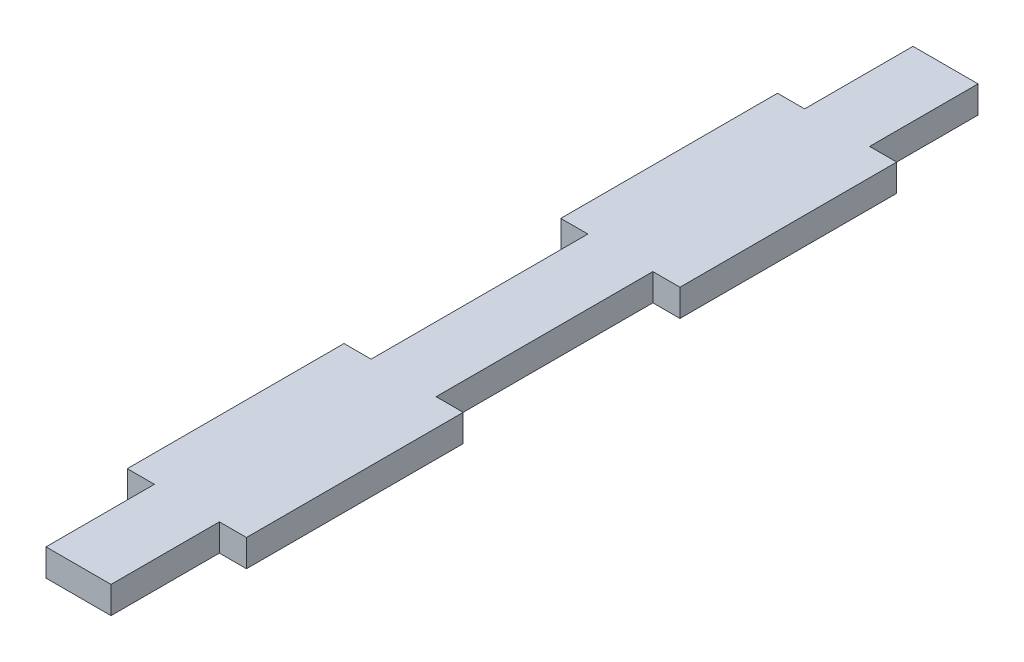
ISO-10303-21;
HEADER;
FILE_DESCRIPTION(('STEP AP214'),'2;1');
FILE_NAME('part.step','',(''),(''),'','','');
FILE_SCHEMA(('AUTOMOTIVE_DESIGN { 1 0 10303 214 1 1 1 1 }'));
ENDSEC;
DATA;
#1=APPLICATION_CONTEXT('core data for automotive mechanical design processes');
#2=APPLICATION_PROTOCOL_DEFINITION('international standard','automotive_design',2000,#1);
#3=PRODUCT_CONTEXT('',#1,'mechanical');
#4=PRODUCT('Part','Part','',(#3));
#5=PRODUCT_RELATED_PRODUCT_CATEGORY('part','',(#4));
#6=PRODUCT_DEFINITION_FORMATION('','',#4);
#7=PRODUCT_DEFINITION_CONTEXT('part definition',#1,'design');
#8=PRODUCT_DEFINITION('design','',#6,#7);
#9=PRODUCT_DEFINITION_SHAPE('','',#8);
#10=(LENGTH_UNIT() NAMED_UNIT(*) SI_UNIT(.MILLI.,.METRE.));
#11=(NAMED_UNIT(*) PLANE_ANGLE_UNIT() SI_UNIT($,.RADIAN.));
#12=(NAMED_UNIT(*) SI_UNIT($,.STERADIAN.) SOLID_ANGLE_UNIT());
#13=UNCERTAINTY_MEASURE_WITH_UNIT(LENGTH_MEASURE(1.E-05),#10,'distance_accuracy_value','');
#14=(GEOMETRIC_REPRESENTATION_CONTEXT(3) GLOBAL_UNCERTAINTY_ASSIGNED_CONTEXT((#13)) GLOBAL_UNIT_ASSIGNED_CONTEXT((#10,
#11,#12)) REPRESENTATION_CONTEXT('',''));
#15=CARTESIAN_POINT('',(0.,0.,0.));
#16=DIRECTION('',(0.,0.,1.));
#17=DIRECTION('',(1.,0.,0.));
#18=AXIS2_PLACEMENT_3D('',#15,#16,#17);
#19=CARTESIAN_POINT('',(10.795,3.175,0.));
#20=DIRECTION('',(1.,0.,0.));
#21=DIRECTION('',(0.,0.,-1.));
#22=AXIS2_PLACEMENT_3D('',#19,#20,#21);
#23=PLANE('',#22);
#24=DIRECTION('',(0.,0.,1.));
#25=VECTOR('',#24,1.);
#26=CARTESIAN_POINT('',(10.795,0.,0.));
#27=LINE('',#26,#25);
#28=CARTESIAN_POINT('',(10.795,0.,-38.1));
#29=VERTEX_POINT('',#28);
#30=CARTESIAN_POINT('',(10.795,0.,-12.7));
#31=VERTEX_POINT('',#30);
#32=EDGE_CURVE('E199',#29,#31,#27,.T.);
#33=ORIENTED_EDGE('',*,*,#32,.F.);
#34=DIRECTION('',(0.,-1.,0.));
#35=VECTOR('',#34,1.);
#36=CARTESIAN_POINT('',(10.795,3.175,-38.1));
#37=LINE('',#36,#35);
#38=CARTESIAN_POINT('',(10.795,3.175,-38.1));
#39=VERTEX_POINT('',#38);
#40=EDGE_CURVE('E11',#39,#29,#37,.T.);
#41=ORIENTED_EDGE('',*,*,#40,.F.);
#42=DIRECTION('',(0.,0.,1.));
#43=VECTOR('',#42,1.);
#44=CARTESIAN_POINT('',(10.795,3.175,0.));
#45=LINE('',#44,#43);
#46=CARTESIAN_POINT('',(10.795,3.175,-12.7));
#47=VERTEX_POINT('',#46);
#48=EDGE_CURVE('E251',#39,#47,#45,.T.);
#49=ORIENTED_EDGE('',*,*,#48,.T.);
#50=DIRECTION('',(0.,-1.,0.));
#51=VECTOR('',#50,1.);
#52=CARTESIAN_POINT('',(10.795,3.175,-12.7));
#53=LINE('',#52,#51);
#54=EDGE_CURVE('E122',#47,#31,#53,.T.);
#55=ORIENTED_EDGE('',*,*,#54,.T.);
#56=EDGE_LOOP('',(#33,#41,#49,#55));
#57=FACE_BOUND('',#56,.T.);
#58=ADVANCED_FACE('F35',(#57),#23,.T.);
#59=CARTESIAN_POINT('',(0.,3.175,-38.1));
#60=DIRECTION('',(0.,0.,-1.));
#61=DIRECTION('',(-1.,0.,0.));
#62=AXIS2_PLACEMENT_3D('',#59,#60,#61);
#63=PLANE('',#62);
#64=DIRECTION('',(1.,0.,0.));
#65=VECTOR('',#64,1.);
#66=CARTESIAN_POINT('',(0.,0.,-38.1));
#67=LINE('',#66,#65);
#68=CARTESIAN_POINT('',(7.62,0.,-38.1));
#69=VERTEX_POINT('',#68);
#70=EDGE_CURVE('E202',#69,#29,#67,.T.);
#71=ORIENTED_EDGE('',*,*,#70,.F.);
#72=DIRECTION('',(0.,-1.,0.));
#73=VECTOR('',#72,1.);
#74=CARTESIAN_POINT('',(7.62,3.175,-38.1));
#75=LINE('',#74,#73);
#76=CARTESIAN_POINT('',(7.62,3.175,-38.1));
#77=VERTEX_POINT('',#76);
#78=EDGE_CURVE('E43',#77,#69,#75,.T.);
#79=ORIENTED_EDGE('',*,*,#78,.F.);
#80=DIRECTION('',(1.,0.,0.));
#81=VECTOR('',#80,1.);
#82=CARTESIAN_POINT('',(0.,3.175,-38.1));
#83=LINE('',#82,#81);
#84=EDGE_CURVE('E299',#77,#39,#83,.T.);
#85=ORIENTED_EDGE('',*,*,#84,.T.);
#86=ORIENTED_EDGE('',*,*,#40,.T.);
#87=EDGE_LOOP('',(#71,#79,#85,#86));
#88=FACE_BOUND('',#87,.T.);
#89=ADVANCED_FACE('F298',(#88),#63,.T.);
#90=CARTESIAN_POINT('',(7.62,3.175,0.));
#91=DIRECTION('',(-1.,0.,0.));
#92=DIRECTION('',(0.,0.,1.));
#93=AXIS2_PLACEMENT_3D('',#90,#91,#92);
#94=PLANE('',#93);
#95=DIRECTION('',(0.,0.,-1.));
#96=VECTOR('',#95,1.);
#97=CARTESIAN_POINT('',(7.62,0.,0.));
#98=LINE('',#97,#96);
#99=CARTESIAN_POINT('',(7.62,0.,-63.5));
#100=VERTEX_POINT('',#99);
#101=EDGE_CURVE('E205',#69,#100,#98,.T.);
#102=ORIENTED_EDGE('',*,*,#101,.T.);
#103=DIRECTION('',(0.,-1.,0.));
#104=VECTOR('',#103,1.);
#105=CARTESIAN_POINT('',(7.62,3.175,-63.5));
#106=LINE('',#105,#104);
#107=CARTESIAN_POINT('',(7.62,3.175,-63.5));
#108=VERTEX_POINT('',#107);
#109=EDGE_CURVE('E283',#108,#100,#106,.T.);
#110=ORIENTED_EDGE('',*,*,#109,.F.);
#111=DIRECTION('',(0.,0.,-1.));
#112=VECTOR('',#111,1.);
#113=CARTESIAN_POINT('',(7.62,3.175,0.));
#114=LINE('',#113,#112);
#115=EDGE_CURVE('E290',#77,#108,#114,.T.);
#116=ORIENTED_EDGE('',*,*,#115,.F.);
#117=ORIENTED_EDGE('',*,*,#78,.T.);
#118=EDGE_LOOP('',(#102,#110,#116,#117));
#119=FACE_BOUND('',#118,.T.);
#120=ADVANCED_FACE('F288',(#119),#94,.F.);
#121=CARTESIAN_POINT('',(0.,3.175,-63.5));
#122=DIRECTION('',(0.,0.,-1.));
#123=DIRECTION('',(-1.,0.,0.));
#124=AXIS2_PLACEMENT_3D('',#121,#122,#123);
#125=PLANE('',#124);
#126=DIRECTION('',(1.,0.,0.));
#127=VECTOR('',#126,1.);
#128=CARTESIAN_POINT('',(0.,0.,-63.5));
#129=LINE('',#128,#127);
#130=CARTESIAN_POINT('',(10.795,0.,-63.5));
#131=VERTEX_POINT('',#130);
#132=EDGE_CURVE('E207',#100,#131,#129,.T.);
#133=ORIENTED_EDGE('',*,*,#132,.T.);
#134=DIRECTION('',(0.,-1.,0.));
#135=VECTOR('',#134,1.);
#136=CARTESIAN_POINT('',(10.795,3.175,-63.5));
#137=LINE('',#136,#135);
#138=CARTESIAN_POINT('',(10.795,3.175,-63.5));
#139=VERTEX_POINT('',#138);
#140=EDGE_CURVE('E281',#139,#131,#137,.T.);
#141=ORIENTED_EDGE('',*,*,#140,.F.);
#142=DIRECTION('',(1.,0.,0.));
#143=VECTOR('',#142,1.);
#144=CARTESIAN_POINT('',(0.,3.175,-63.5));
#145=LINE('',#144,#143);
#146=EDGE_CURVE('E307',#108,#139,#145,.T.);
#147=ORIENTED_EDGE('',*,*,#146,.F.);
#148=ORIENTED_EDGE('',*,*,#109,.T.);
#149=EDGE_LOOP('',(#133,#141,#147,#148));
#150=FACE_BOUND('',#149,.T.);
#151=ADVANCED_FACE('F395',(#150),#125,.F.);
#152=CARTESIAN_POINT('',(10.795,3.175,0.));
#153=DIRECTION('',(1.,0.,0.));
#154=DIRECTION('',(0.,0.,-1.));
#155=AXIS2_PLACEMENT_3D('',#152,#153,#154);
#156=PLANE('',#155);
#157=DIRECTION('',(0.,0.,1.));
#158=VECTOR('',#157,1.);
#159=CARTESIAN_POINT('',(10.795,0.,0.));
#160=LINE('',#159,#158);
#161=CARTESIAN_POINT('',(10.795,0.,-88.9));
#162=VERTEX_POINT('',#161);
#163=EDGE_CURVE('E210',#162,#131,#160,.T.);
#164=ORIENTED_EDGE('',*,*,#163,.F.);
#165=DIRECTION('',(0.,-1.,0.));
#166=VECTOR('',#165,1.);
#167=CARTESIAN_POINT('',(10.795,3.175,-88.9));
#168=LINE('',#167,#166);
#169=CARTESIAN_POINT('',(10.795,3.175,-88.9));
#170=VERTEX_POINT('',#169);
#171=EDGE_CURVE('E279',#170,#162,#168,.T.);
#172=ORIENTED_EDGE('',*,*,#171,.F.);
#173=DIRECTION('',(0.,0.,1.));
#174=VECTOR('',#173,1.);
#175=CARTESIAN_POINT('',(10.795,3.175,0.));
#176=LINE('',#175,#174);
#177=EDGE_CURVE('E309',#170,#139,#176,.T.);
#178=ORIENTED_EDGE('',*,*,#177,.T.);
#179=ORIENTED_EDGE('',*,*,#140,.T.);
#180=EDGE_LOOP('',(#164,#172,#178,#179));
#181=FACE_BOUND('',#180,.T.);
#182=ADVANCED_FACE('F391',(#181),#156,.T.);
#183=CARTESIAN_POINT('',(0.,3.175,-88.9));
#184=DIRECTION('',(0.,0.,-1.));
#185=DIRECTION('',(-1.,0.,0.));
#186=AXIS2_PLACEMENT_3D('',#183,#184,#185);
#187=PLANE('',#186);
#188=DIRECTION('',(1.,0.,0.));
#189=VECTOR('',#188,1.);
#190=CARTESIAN_POINT('',(0.,0.,-88.9));
#191=LINE('',#190,#189);
#192=CARTESIAN_POINT('',(7.62,0.,-88.9));
#193=VERTEX_POINT('',#192);
#194=EDGE_CURVE('E213',#193,#162,#191,.T.);
#195=ORIENTED_EDGE('',*,*,#194,.F.);
#196=DIRECTION('',(0.,-1.,0.));
#197=VECTOR('',#196,1.);
#198=CARTESIAN_POINT('',(7.62,3.175,-88.9));
#199=LINE('',#198,#197);
#200=CARTESIAN_POINT('',(7.62,3.175,-88.9));
#201=VERTEX_POINT('',#200);
#202=EDGE_CURVE('E277',#201,#193,#199,.T.);
#203=ORIENTED_EDGE('',*,*,#202,.F.);
#204=DIRECTION('',(1.,0.,0.));
#205=VECTOR('',#204,1.);
#206=CARTESIAN_POINT('',(0.,3.175,-88.9));
#207=LINE('',#206,#205);
#208=EDGE_CURVE('E312',#201,#170,#207,.T.);
#209=ORIENTED_EDGE('',*,*,#208,.T.);
#210=ORIENTED_EDGE('',*,*,#171,.T.);
#211=EDGE_LOOP('',(#195,#203,#209,#210));
#212=FACE_BOUND('',#211,.T.);
#213=ADVANCED_FACE('F387',(#212),#187,.T.);
#214=CARTESIAN_POINT('',(7.62000000000001,3.175,0.));
#215=DIRECTION('',(1.,0.,0.));
#216=DIRECTION('',(0.,0.,-1.));
#217=AXIS2_PLACEMENT_3D('',#214,#215,#216);
#218=PLANE('',#217);
#219=DIRECTION('',(0.,0.,1.));
#220=VECTOR('',#219,1.);
#221=CARTESIAN_POINT('',(7.62000000000001,0.,0.));
#222=LINE('',#221,#220);
#223=CARTESIAN_POINT('',(7.62,0.,-101.6));
#224=VERTEX_POINT('',#223);
#225=EDGE_CURVE('E216',#224,#193,#222,.T.);
#226=ORIENTED_EDGE('',*,*,#225,.F.);
#227=DIRECTION('',(0.,-1.,0.));
#228=VECTOR('',#227,1.);
#229=CARTESIAN_POINT('',(7.62,3.175,-101.6));
#230=LINE('',#229,#228);
#231=CARTESIAN_POINT('',(7.62,3.175,-101.6));
#232=VERTEX_POINT('',#231);
#233=EDGE_CURVE('E275',#232,#224,#230,.T.);
#234=ORIENTED_EDGE('',*,*,#233,.F.);
#235=DIRECTION('',(0.,0.,1.));
#236=VECTOR('',#235,1.);
#237=CARTESIAN_POINT('',(7.62000000000001,3.175,0.));
#238=LINE('',#237,#236);
#239=EDGE_CURVE('E315',#232,#201,#238,.T.);
#240=ORIENTED_EDGE('',*,*,#239,.T.);
#241=ORIENTED_EDGE('',*,*,#202,.T.);
#242=EDGE_LOOP('',(#226,#234,#240,#241));
#243=FACE_BOUND('',#242,.T.);
#244=ADVANCED_FACE('F383',(#243),#218,.T.);
#245=CARTESIAN_POINT('',(0.,3.175,-101.6));
#246=DIRECTION('',(0.,0.,-1.));
#247=DIRECTION('',(-1.,0.,0.));
#248=AXIS2_PLACEMENT_3D('',#245,#246,#247);
#249=PLANE('',#248);
#250=DIRECTION('',(1.,0.,0.));
#251=VECTOR('',#250,1.);
#252=CARTESIAN_POINT('',(0.,0.,-101.6));
#253=LINE('',#252,#251);
#254=CARTESIAN_POINT('',(0.,0.,-101.6));
#255=VERTEX_POINT('',#254);
#256=EDGE_CURVE('E219',#255,#224,#253,.T.);
#257=ORIENTED_EDGE('',*,*,#256,.F.);
#258=DIRECTION('',(0.,-1.,0.));
#259=VECTOR('',#258,1.);
#260=CARTESIAN_POINT('',(0.,3.175,-101.6));
#261=LINE('',#260,#259);
#262=CARTESIAN_POINT('',(0.,3.175,-101.6));
#263=VERTEX_POINT('',#262);
#264=EDGE_CURVE('E273',#263,#255,#261,.T.);
#265=ORIENTED_EDGE('',*,*,#264,.F.);
#266=DIRECTION('',(1.,0.,0.));
#267=VECTOR('',#266,1.);
#268=CARTESIAN_POINT('',(0.,3.175,-101.6));
#269=LINE('',#268,#267);
#270=EDGE_CURVE('E318',#263,#232,#269,.T.);
#271=ORIENTED_EDGE('',*,*,#270,.T.);
#272=ORIENTED_EDGE('',*,*,#233,.T.);
#273=EDGE_LOOP('',(#257,#265,#271,#272));
#274=FACE_BOUND('',#273,.T.);
#275=ADVANCED_FACE('F379',(#274),#249,.T.);
#276=CARTESIAN_POINT('',(0.,3.175,0.));
#277=DIRECTION('',(-1.,0.,0.));
#278=DIRECTION('',(0.,0.,1.));
#279=AXIS2_PLACEMENT_3D('',#276,#277,#278);
#280=PLANE('',#279);
#281=DIRECTION('',(0.,0.,-1.));
#282=VECTOR('',#281,1.);
#283=CARTESIAN_POINT('',(0.,0.,0.));
#284=LINE('',#283,#282);
#285=CARTESIAN_POINT('',(0.,0.,-88.9));
#286=VERTEX_POINT('',#285);
#287=EDGE_CURVE('E222',#286,#255,#284,.T.);
#288=ORIENTED_EDGE('',*,*,#287,.F.);
#289=DIRECTION('',(0.,-1.,0.));
#290=VECTOR('',#289,1.);
#291=CARTESIAN_POINT('',(0.,3.175,-88.9));
#292=LINE('',#291,#290);
#293=CARTESIAN_POINT('',(0.,3.175,-88.9));
#294=VERTEX_POINT('',#293);
#295=EDGE_CURVE('E271',#294,#286,#292,.T.);
#296=ORIENTED_EDGE('',*,*,#295,.F.);
#297=DIRECTION('',(0.,0.,-1.));
#298=VECTOR('',#297,1.);
#299=CARTESIAN_POINT('',(0.,3.175,0.));
#300=LINE('',#299,#298);
#301=EDGE_CURVE('E321',#294,#263,#300,.T.);
#302=ORIENTED_EDGE('',*,*,#301,.T.);
#303=ORIENTED_EDGE('',*,*,#264,.T.);
#304=EDGE_LOOP('',(#288,#296,#302,#303));
#305=FACE_BOUND('',#304,.T.);
#306=ADVANCED_FACE('F373',(#305),#280,.T.);
#307=CARTESIAN_POINT('',(0.,3.175,-88.9));
#308=DIRECTION('',(0.,0.,1.));
#309=DIRECTION('',(1.,0.,0.));
#310=AXIS2_PLACEMENT_3D('',#307,#308,#309);
#311=PLANE('',#310);
#312=DIRECTION('',(-1.,0.,0.));
#313=VECTOR('',#312,1.);
#314=CARTESIAN_POINT('',(0.,0.,-88.9));
#315=LINE('',#314,#313);
#316=CARTESIAN_POINT('',(-3.175,0.,-88.9));
#317=VERTEX_POINT('',#316);
#318=EDGE_CURVE('E225',#286,#317,#315,.T.);
#319=ORIENTED_EDGE('',*,*,#318,.T.);
#320=DIRECTION('',(0.,-1.,0.));
#321=VECTOR('',#320,1.);
#322=CARTESIAN_POINT('',(-3.175,3.175,-88.9));
#323=LINE('',#322,#321);
#324=CARTESIAN_POINT('',(-3.175,3.175,-88.9));
#325=VERTEX_POINT('',#324);
#326=EDGE_CURVE('E268',#325,#317,#323,.T.);
#327=ORIENTED_EDGE('',*,*,#326,.F.);
#328=DIRECTION('',(-1.,0.,0.));
#329=VECTOR('',#328,1.);
#330=CARTESIAN_POINT('',(0.,3.175,-88.9));
#331=LINE('',#330,#329);
#332=EDGE_CURVE('E324',#294,#325,#331,.T.);
#333=ORIENTED_EDGE('',*,*,#332,.F.);
#334=ORIENTED_EDGE('',*,*,#295,.T.);
#335=EDGE_LOOP('',(#319,#327,#333,#334));
#336=FACE_BOUND('',#335,.T.);
#337=ADVANCED_FACE('F396',(#336),#311,.F.);
#338=CARTESIAN_POINT('',(-3.175,3.175,0.));
#339=DIRECTION('',(1.,0.,0.));
#340=DIRECTION('',(0.,0.,-1.));
#341=AXIS2_PLACEMENT_3D('',#338,#339,#340);
#342=PLANE('',#341);
#343=DIRECTION('',(0.,0.,1.));
#344=VECTOR('',#343,1.);
#345=CARTESIAN_POINT('',(-3.175,0.,0.));
#346=LINE('',#345,#344);
#347=CARTESIAN_POINT('',(-3.175,0.,-63.5));
#348=VERTEX_POINT('',#347);
#349=EDGE_CURVE('E227',#317,#348,#346,.T.);
#350=ORIENTED_EDGE('',*,*,#349,.T.);
#351=DIRECTION('',(0.,-1.,0.));
#352=VECTOR('',#351,1.);
#353=CARTESIAN_POINT('',(-3.175,3.175,-63.5));
#354=LINE('',#353,#352);
#355=CARTESIAN_POINT('',(-3.175,3.175,-63.5));
#356=VERTEX_POINT('',#355);
#357=EDGE_CURVE('E266',#356,#348,#354,.T.);
#358=ORIENTED_EDGE('',*,*,#357,.F.);
#359=DIRECTION('',(0.,0.,1.));
#360=VECTOR('',#359,1.);
#361=CARTESIAN_POINT('',(-3.175,3.175,0.));
#362=LINE('',#361,#360);
#363=EDGE_CURVE('E326',#325,#356,#362,.T.);
#364=ORIENTED_EDGE('',*,*,#363,.F.);
#365=ORIENTED_EDGE('',*,*,#326,.T.);
#366=EDGE_LOOP('',(#350,#358,#364,#365));
#367=FACE_BOUND('',#366,.T.);
#368=ADVANCED_FACE('F367',(#367),#342,.F.);
#369=CARTESIAN_POINT('',(0.,3.175,-63.5));
#370=DIRECTION('',(0.,0.,1.));
#371=DIRECTION('',(1.,0.,0.));
#372=AXIS2_PLACEMENT_3D('',#369,#370,#371);
#373=PLANE('',#372);
#374=DIRECTION('',(-1.,0.,0.));
#375=VECTOR('',#374,1.);
#376=CARTESIAN_POINT('',(0.,0.,-63.5));
#377=LINE('',#376,#375);
#378=CARTESIAN_POINT('',(0.,0.,-63.5));
#379=VERTEX_POINT('',#378);
#380=EDGE_CURVE('E230',#379,#348,#377,.T.);
#381=ORIENTED_EDGE('',*,*,#380,.F.);
#382=DIRECTION('',(0.,-1.,0.));
#383=VECTOR('',#382,1.);
#384=CARTESIAN_POINT('',(0.,3.175,-63.5));
#385=LINE('',#384,#383);
#386=CARTESIAN_POINT('',(0.,3.175,-63.5));
#387=VERTEX_POINT('',#386);
#388=EDGE_CURVE('E264',#387,#379,#385,.T.);
#389=ORIENTED_EDGE('',*,*,#388,.F.);
#390=DIRECTION('',(-1.,0.,0.));
#391=VECTOR('',#390,1.);
#392=CARTESIAN_POINT('',(0.,3.175,-63.5));
#393=LINE('',#392,#391);
#394=EDGE_CURVE('E328',#387,#356,#393,.T.);
#395=ORIENTED_EDGE('',*,*,#394,.T.);
#396=ORIENTED_EDGE('',*,*,#357,.T.);
#397=EDGE_LOOP('',(#381,#389,#395,#396));
#398=FACE_BOUND('',#397,.T.);
#399=ADVANCED_FACE('F361',(#398),#373,.T.);
#400=CARTESIAN_POINT('',(0.,3.175,0.));
#401=DIRECTION('',(1.,0.,0.));
#402=DIRECTION('',(0.,0.,-1.));
#403=AXIS2_PLACEMENT_3D('',#400,#401,#402);
#404=PLANE('',#403);
#405=DIRECTION('',(0.,0.,1.));
#406=VECTOR('',#405,1.);
#407=CARTESIAN_POINT('',(0.,0.,0.));
#408=LINE('',#407,#406);
#409=CARTESIAN_POINT('',(0.,0.,-38.1));
#410=VERTEX_POINT('',#409);
#411=EDGE_CURVE('E233',#379,#410,#408,.T.);
#412=ORIENTED_EDGE('',*,*,#411,.T.);
#413=DIRECTION('',(0.,-1.,0.));
#414=VECTOR('',#413,1.);
#415=CARTESIAN_POINT('',(0.,3.175,-38.1));
#416=LINE('',#415,#414);
#417=CARTESIAN_POINT('',(0.,3.175,-38.1));
#418=VERTEX_POINT('',#417);
#419=EDGE_CURVE('E261',#418,#410,#416,.T.);
#420=ORIENTED_EDGE('',*,*,#419,.F.);
#421=DIRECTION('',(0.,0.,1.));
#422=VECTOR('',#421,1.);
#423=CARTESIAN_POINT('',(0.,3.175,0.));
#424=LINE('',#423,#422);
#425=EDGE_CURVE('E331',#387,#418,#424,.T.);
#426=ORIENTED_EDGE('',*,*,#425,.F.);
#427=ORIENTED_EDGE('',*,*,#388,.T.);
#428=EDGE_LOOP('',(#412,#420,#426,#427));
#429=FACE_BOUND('',#428,.T.);
#430=ADVANCED_FACE('F453',(#429),#404,.F.);
#431=CARTESIAN_POINT('',(0.,3.175,-38.1));
#432=DIRECTION('',(0.,0.,1.));
#433=DIRECTION('',(1.,0.,0.));
#434=AXIS2_PLACEMENT_3D('',#431,#432,#433);
#435=PLANE('',#434);
#436=DIRECTION('',(-1.,0.,0.));
#437=VECTOR('',#436,1.);
#438=CARTESIAN_POINT('',(0.,0.,-38.1));
#439=LINE('',#438,#437);
#440=CARTESIAN_POINT('',(-3.175,0.,-38.1));
#441=VERTEX_POINT('',#440);
#442=EDGE_CURVE('E235',#410,#441,#439,.T.);
#443=ORIENTED_EDGE('',*,*,#442,.T.);
#444=DIRECTION('',(0.,-1.,0.));
#445=VECTOR('',#444,1.);
#446=CARTESIAN_POINT('',(-3.175,3.175,-38.1));
#447=LINE('',#446,#445);
#448=CARTESIAN_POINT('',(-3.175,3.175,-38.1));
#449=VERTEX_POINT('',#448);
#450=EDGE_CURVE('E259',#449,#441,#447,.T.);
#451=ORIENTED_EDGE('',*,*,#450,.F.);
#452=DIRECTION('',(-1.,0.,0.));
#453=VECTOR('',#452,1.);
#454=CARTESIAN_POINT('',(0.,3.175,-38.1));
#455=LINE('',#454,#453);
#456=EDGE_CURVE('E333',#418,#449,#455,.T.);
#457=ORIENTED_EDGE('',*,*,#456,.F.);
#458=ORIENTED_EDGE('',*,*,#419,.T.);
#459=EDGE_LOOP('',(#443,#451,#457,#458));
#460=FACE_BOUND('',#459,.T.);
#461=ADVANCED_FACE('F354',(#460),#435,.F.);
#462=CARTESIAN_POINT('',(-3.175,3.175,0.));
#463=DIRECTION('',(-1.,0.,0.));
#464=DIRECTION('',(0.,0.,1.));
#465=AXIS2_PLACEMENT_3D('',#462,#463,#464);
#466=PLANE('',#465);
#467=DIRECTION('',(0.,0.,-1.));
#468=VECTOR('',#467,1.);
#469=CARTESIAN_POINT('',(-3.175,0.,0.));
#470=LINE('',#469,#468);
#471=CARTESIAN_POINT('',(-3.175,0.,-12.7));
#472=VERTEX_POINT('',#471);
#473=EDGE_CURVE('E238',#472,#441,#470,.T.);
#474=ORIENTED_EDGE('',*,*,#473,.F.);
#475=DIRECTION('',(0.,-1.,0.));
#476=VECTOR('',#475,1.);
#477=CARTESIAN_POINT('',(-3.175,3.175,-12.7));
#478=LINE('',#477,#476);
#479=CARTESIAN_POINT('',(-3.175,3.175,-12.7));
#480=VERTEX_POINT('',#479);
#481=EDGE_CURVE('E257',#480,#472,#478,.T.);
#482=ORIENTED_EDGE('',*,*,#481,.F.);
#483=DIRECTION('',(0.,0.,-1.));
#484=VECTOR('',#483,1.);
#485=CARTESIAN_POINT('',(-3.175,3.175,0.));
#486=LINE('',#485,#484);
#487=EDGE_CURVE('E335',#480,#449,#486,.T.);
#488=ORIENTED_EDGE('',*,*,#487,.T.);
#489=ORIENTED_EDGE('',*,*,#450,.T.);
#490=EDGE_LOOP('',(#474,#482,#488,#489));
#491=FACE_BOUND('',#490,.T.);
#492=ADVANCED_FACE('F350',(#491),#466,.T.);
#493=CARTESIAN_POINT('',(0.,3.175,-12.7));
#494=DIRECTION('',(0.,0.,1.));
#495=DIRECTION('',(1.,0.,0.));
#496=AXIS2_PLACEMENT_3D('',#493,#494,#495);
#497=PLANE('',#496);
#498=DIRECTION('',(-1.,0.,0.));
#499=VECTOR('',#498,1.);
#500=CARTESIAN_POINT('',(0.,0.,-12.7));
#501=LINE('',#500,#499);
#502=CARTESIAN_POINT('',(0.,0.,-12.7));
#503=VERTEX_POINT('',#502);
#504=EDGE_CURVE('E241',#503,#472,#501,.T.);
#505=ORIENTED_EDGE('',*,*,#504,.F.);
#506=DIRECTION('',(0.,-1.,0.));
#507=VECTOR('',#506,1.);
#508=CARTESIAN_POINT('',(0.,3.175,-12.7));
#509=LINE('',#508,#507);
#510=CARTESIAN_POINT('',(0.,3.175,-12.7));
#511=VERTEX_POINT('',#510);
#512=EDGE_CURVE('E255',#511,#503,#509,.T.);
#513=ORIENTED_EDGE('',*,*,#512,.F.);
#514=DIRECTION('',(-1.,0.,0.));
#515=VECTOR('',#514,1.);
#516=CARTESIAN_POINT('',(0.,3.175,-12.7));
#517=LINE('',#516,#515);
#518=EDGE_CURVE('E338',#511,#480,#517,.T.);
#519=ORIENTED_EDGE('',*,*,#518,.T.);
#520=ORIENTED_EDGE('',*,*,#481,.T.);
#521=EDGE_LOOP('',(#505,#513,#519,#520));
#522=FACE_BOUND('',#521,.T.);
#523=ADVANCED_FACE('F347',(#522),#497,.T.);
#524=CARTESIAN_POINT('',(0.,3.175,0.));
#525=DIRECTION('',(-1.,0.,0.));
#526=DIRECTION('',(0.,0.,1.));
#527=AXIS2_PLACEMENT_3D('',#524,#525,#526);
#528=PLANE('',#527);
#529=DIRECTION('',(0.,0.,-1.));
#530=VECTOR('',#529,1.);
#531=CARTESIAN_POINT('',(0.,0.,0.));
#532=LINE('',#531,#530);
#533=CARTESIAN_POINT('',(0.,0.,0.));
#534=VERTEX_POINT('',#533);
#535=EDGE_CURVE('E244',#534,#503,#532,.T.);
#536=ORIENTED_EDGE('',*,*,#535,.F.);
#537=DIRECTION('',(0.,-1.,0.));
#538=VECTOR('',#537,1.);
#539=CARTESIAN_POINT('',(0.,3.175,0.));
#540=LINE('',#539,#538);
#541=CARTESIAN_POINT('',(0.,3.175,0.));
#542=VERTEX_POINT('',#541);
#543=EDGE_CURVE('E191',#542,#534,#540,.T.);
#544=ORIENTED_EDGE('',*,*,#543,.F.);
#545=DIRECTION('',(0.,0.,-1.));
#546=VECTOR('',#545,1.);
#547=CARTESIAN_POINT('',(0.,3.175,0.));
#548=LINE('',#547,#546);
#549=EDGE_CURVE('E184',#542,#511,#548,.T.);
#550=ORIENTED_EDGE('',*,*,#549,.T.);
#551=ORIENTED_EDGE('',*,*,#512,.T.);
#552=EDGE_LOOP('',(#536,#544,#550,#551));
#553=FACE_BOUND('',#552,.T.);
#554=ADVANCED_FACE('F342',(#553),#528,.T.);
#555=CARTESIAN_POINT('',(0.,3.175,0.));
#556=DIRECTION('',(0.,0.,-1.));
#557=DIRECTION('',(-1.,0.,0.));
#558=AXIS2_PLACEMENT_3D('',#555,#556,#557);
#559=PLANE('',#558);
#560=DIRECTION('',(1.,0.,0.));
#561=VECTOR('',#560,1.);
#562=CARTESIAN_POINT('',(0.,0.,0.));
#563=LINE('',#562,#561);
#564=CARTESIAN_POINT('',(7.62,0.,0.));
#565=VERTEX_POINT('',#564);
#566=EDGE_CURVE('E190',#534,#565,#563,.T.);
#567=ORIENTED_EDGE('',*,*,#566,.T.);
#568=DIRECTION('',(0.,-1.,0.));
#569=VECTOR('',#568,1.);
#570=CARTESIAN_POINT('',(7.62,3.175,0.));
#571=LINE('',#570,#569);
#572=CARTESIAN_POINT('',(7.62,3.175,0.));
#573=VERTEX_POINT('',#572);
#574=EDGE_CURVE('E187',#573,#565,#571,.T.);
#575=ORIENTED_EDGE('',*,*,#574,.F.);
#576=DIRECTION('',(1.,0.,0.));
#577=VECTOR('',#576,1.);
#578=CARTESIAN_POINT('',(0.,3.175,0.));
#579=LINE('',#578,#577);
#580=EDGE_CURVE('E177',#542,#573,#579,.T.);
#581=ORIENTED_EDGE('',*,*,#580,.F.);
#582=ORIENTED_EDGE('',*,*,#543,.T.);
#583=EDGE_LOOP('',(#567,#575,#581,#582));
#584=FACE_BOUND('',#583,.T.);
#585=ADVANCED_FACE('F188',(#584),#559,.F.);
#586=CARTESIAN_POINT('',(7.62,3.175,0.));
#587=DIRECTION('',(-1.,0.,0.));
#588=DIRECTION('',(0.,0.,1.));
#589=AXIS2_PLACEMENT_3D('',#586,#587,#588);
#590=PLANE('',#589);
#591=DIRECTION('',(0.,0.,-1.));
#592=VECTOR('',#591,1.);
#593=CARTESIAN_POINT('',(7.62,0.,0.));
#594=LINE('',#593,#592);
#595=CARTESIAN_POINT('',(7.62,0.,-12.7));
#596=VERTEX_POINT('',#595);
#597=EDGE_CURVE('E115',#565,#596,#594,.T.);
#598=ORIENTED_EDGE('',*,*,#597,.T.);
#599=DIRECTION('',(0.,-1.,0.));
#600=VECTOR('',#599,1.);
#601=CARTESIAN_POINT('',(7.62,3.175,-12.7));
#602=LINE('',#601,#600);
#603=CARTESIAN_POINT('',(7.62,3.175,-12.7));
#604=VERTEX_POINT('',#603);
#605=EDGE_CURVE('E192',#604,#596,#602,.T.);
#606=ORIENTED_EDGE('',*,*,#605,.F.);
#607=DIRECTION('',(0.,0.,-1.));
#608=VECTOR('',#607,1.);
#609=CARTESIAN_POINT('',(7.62,3.175,0.));
#610=LINE('',#609,#608);
#611=EDGE_CURVE('E181',#573,#604,#610,.T.);
#612=ORIENTED_EDGE('',*,*,#611,.F.);
#613=ORIENTED_EDGE('',*,*,#574,.T.);
#614=EDGE_LOOP('',(#598,#606,#612,#613));
#615=FACE_BOUND('',#614,.T.);
#616=ADVANCED_FACE('F194',(#615),#590,.F.);
#617=CARTESIAN_POINT('',(0.,3.175,-12.7));
#618=DIRECTION('',(0.,0.,-1.));
#619=DIRECTION('',(-1.,0.,0.));
#620=AXIS2_PLACEMENT_3D('',#617,#618,#619);
#621=PLANE('',#620);
#622=DIRECTION('',(1.,0.,0.));
#623=VECTOR('',#622,1.);
#624=CARTESIAN_POINT('',(0.,0.,-12.7));
#625=LINE('',#624,#623);
#626=EDGE_CURVE('E249',#596,#31,#625,.T.);
#627=ORIENTED_EDGE('',*,*,#626,.T.);
#628=ORIENTED_EDGE('',*,*,#54,.F.);
#629=DIRECTION('',(1.,0.,0.));
#630=VECTOR('',#629,1.);
#631=CARTESIAN_POINT('',(0.,3.175,-12.7));
#632=LINE('',#631,#630);
#633=EDGE_CURVE('E51',#604,#47,#632,.T.);
#634=ORIENTED_EDGE('',*,*,#633,.F.);
#635=ORIENTED_EDGE('',*,*,#605,.T.);
#636=EDGE_LOOP('',(#627,#628,#634,#635));
#637=FACE_BOUND('',#636,.T.);
#638=ADVANCED_FACE('F302',(#637),#621,.F.);
#639=CARTESIAN_POINT('',(0.,3.175,0.));
#640=DIRECTION('',(0.,1.,0.));
#641=DIRECTION('',(0.,0.,1.));
#642=AXIS2_PLACEMENT_3D('',#639,#640,#641);
#643=PLANE('',#642);
#644=ORIENTED_EDGE('',*,*,#48,.F.);
#645=ORIENTED_EDGE('',*,*,#84,.F.);
#646=ORIENTED_EDGE('',*,*,#115,.T.);
#647=ORIENTED_EDGE('',*,*,#146,.T.);
#648=ORIENTED_EDGE('',*,*,#177,.F.);
#649=ORIENTED_EDGE('',*,*,#208,.F.);
#650=ORIENTED_EDGE('',*,*,#239,.F.);
#651=ORIENTED_EDGE('',*,*,#270,.F.);
#652=ORIENTED_EDGE('',*,*,#301,.F.);
#653=ORIENTED_EDGE('',*,*,#332,.T.);
#654=ORIENTED_EDGE('',*,*,#363,.T.);
#655=ORIENTED_EDGE('',*,*,#394,.F.);
#656=ORIENTED_EDGE('',*,*,#425,.T.);
#657=ORIENTED_EDGE('',*,*,#456,.T.);
#658=ORIENTED_EDGE('',*,*,#487,.F.);
#659=ORIENTED_EDGE('',*,*,#518,.F.);
#660=ORIENTED_EDGE('',*,*,#549,.F.);
#661=ORIENTED_EDGE('',*,*,#580,.T.);
#662=ORIENTED_EDGE('',*,*,#611,.T.);
#663=ORIENTED_EDGE('',*,*,#633,.T.);
#664=EDGE_LOOP('',(#644,#645,#646,#647,#648,#649,#650,#651,#652,#653,#654,#655,#656,#657,#658,
#659,#660,#661,#662,#663));
#665=FACE_BOUND('',#664,.T.);
#666=ADVANCED_FACE('F179',(#665),#643,.T.);
#667=CARTESIAN_POINT('',(0.,0.,0.));
#668=DIRECTION('',(0.,1.,0.));
#669=DIRECTION('',(0.,0.,1.));
#670=AXIS2_PLACEMENT_3D('',#667,#668,#669);
#671=PLANE('',#670);
#672=ORIENTED_EDGE('',*,*,#32,.T.);
#673=ORIENTED_EDGE('',*,*,#626,.F.);
#674=ORIENTED_EDGE('',*,*,#597,.F.);
#675=ORIENTED_EDGE('',*,*,#566,.F.);
#676=ORIENTED_EDGE('',*,*,#535,.T.);
#677=ORIENTED_EDGE('',*,*,#504,.T.);
#678=ORIENTED_EDGE('',*,*,#473,.T.);
#679=ORIENTED_EDGE('',*,*,#442,.F.);
#680=ORIENTED_EDGE('',*,*,#411,.F.);
#681=ORIENTED_EDGE('',*,*,#380,.T.);
#682=ORIENTED_EDGE('',*,*,#349,.F.);
#683=ORIENTED_EDGE('',*,*,#318,.F.);
#684=ORIENTED_EDGE('',*,*,#287,.T.);
#685=ORIENTED_EDGE('',*,*,#256,.T.);
#686=ORIENTED_EDGE('',*,*,#225,.T.);
#687=ORIENTED_EDGE('',*,*,#194,.T.);
#688=ORIENTED_EDGE('',*,*,#163,.T.);
#689=ORIENTED_EDGE('',*,*,#132,.F.);
#690=ORIENTED_EDGE('',*,*,#101,.F.);
#691=ORIENTED_EDGE('',*,*,#70,.T.);
#692=EDGE_LOOP('',(#672,#673,#674,#675,#676,#677,#678,#679,#680,#681,#682,#683,#684,#685,#686,
#687,#688,#689,#690,#691));
#693=FACE_BOUND('',#692,.T.);
#694=ADVANCED_FACE('F297',(#693),#671,.F.);
#695=CLOSED_SHELL('',(#58,#89,#120,#151,#182,#213,#244,#275,#306,#337,#368,#399,#430,#461,#492,
#523,#554,#585,#616,#638,#666,#694));
#696=MANIFOLD_SOLID_BREP('B2',#695);
#697=ADVANCED_BREP_SHAPE_REPRESENTATION('',(#18,#696),#14);
#698=SHAPE_DEFINITION_REPRESENTATION(#9,#697);
ENDSEC;
END-ISO-10303-21;
